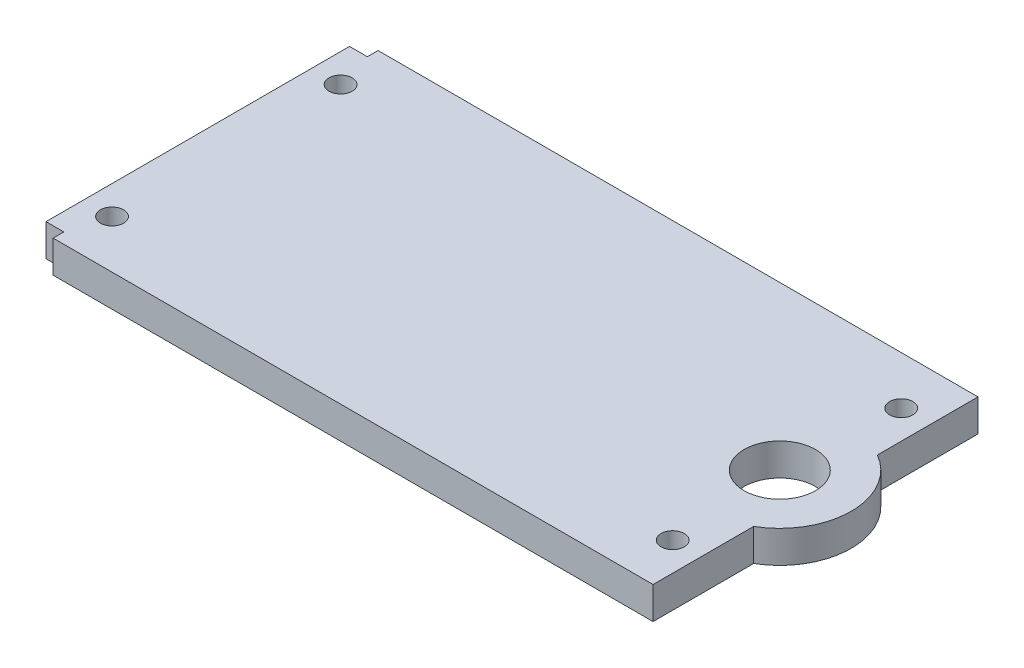
ISO-10303-21;
HEADER;
FILE_DESCRIPTION(('STEP AP214'),'2;1');
FILE_NAME('part.step','',(''),(''),'','','');
FILE_SCHEMA(('AUTOMOTIVE_DESIGN { 1 0 10303 214 1 1 1 1 }'));
ENDSEC;
DATA;
#1=APPLICATION_CONTEXT('core data for automotive mechanical design processes');
#2=APPLICATION_PROTOCOL_DEFINITION('international standard','automotive_design',2000,#1);
#3=PRODUCT_CONTEXT('',#1,'mechanical');
#4=PRODUCT('Part','Part','',(#3));
#5=PRODUCT_RELATED_PRODUCT_CATEGORY('part','',(#4));
#6=PRODUCT_DEFINITION_FORMATION('','',#4);
#7=PRODUCT_DEFINITION_CONTEXT('part definition',#1,'design');
#8=PRODUCT_DEFINITION('design','',#6,#7);
#9=PRODUCT_DEFINITION_SHAPE('','',#8);
#10=(LENGTH_UNIT() NAMED_UNIT(*) SI_UNIT(.MILLI.,.METRE.));
#11=(NAMED_UNIT(*) PLANE_ANGLE_UNIT() SI_UNIT($,.RADIAN.));
#12=(NAMED_UNIT(*) SI_UNIT($,.STERADIAN.) SOLID_ANGLE_UNIT());
#13=UNCERTAINTY_MEASURE_WITH_UNIT(LENGTH_MEASURE(1.E-05),#10,'distance_accuracy_value','');
#14=(GEOMETRIC_REPRESENTATION_CONTEXT(3) GLOBAL_UNCERTAINTY_ASSIGNED_CONTEXT((#13)) GLOBAL_UNIT_ASSIGNED_CONTEXT((#10,
#11,#12)) REPRESENTATION_CONTEXT('',''));
#15=CARTESIAN_POINT('',(0.,0.,0.));
#16=DIRECTION('',(0.,0.,1.));
#17=DIRECTION('',(1.,0.,0.));
#18=AXIS2_PLACEMENT_3D('',#15,#16,#17);
#19=CARTESIAN_POINT('',(45.,4.5,22.75));
#20=DIRECTION('',(-1.,0.,0.));
#21=DIRECTION('',(0.,0.,1.));
#22=AXIS2_PLACEMENT_3D('',#19,#20,#21);
#23=PLANE('',#22);
#24=DIRECTION('',(0.,0.,-1.));
#25=VECTOR('',#24,1.);
#26=CARTESIAN_POINT('',(45.,0.,22.75));
#27=LINE('',#26,#25);
#28=CARTESIAN_POINT('',(45.,0.,22.75));
#29=VERTEX_POINT('',#28);
#30=CARTESIAN_POINT('',(45.,0.,8.66025403784439));
#31=VERTEX_POINT('',#30);
#32=EDGE_CURVE('E130',#29,#31,#27,.T.);
#33=ORIENTED_EDGE('',*,*,#32,.T.);
#34=DIRECTION('',(0.,1.,0.));
#35=VECTOR('',#34,1.);
#36=CARTESIAN_POINT('',(45.,-28.2842712474619,8.66025403784439));
#37=LINE('',#36,#35);
#38=CARTESIAN_POINT('',(45.,4.5,8.66025403784439));
#39=VERTEX_POINT('',#38);
#40=EDGE_CURVE('E181',#31,#39,#37,.T.);
#41=ORIENTED_EDGE('',*,*,#40,.T.);
#42=DIRECTION('',(0.,0.,-1.));
#43=VECTOR('',#42,1.);
#44=CARTESIAN_POINT('',(45.,4.5,22.75));
#45=LINE('',#44,#43);
#46=CARTESIAN_POINT('',(45.,4.5,22.75));
#47=VERTEX_POINT('',#46);
#48=EDGE_CURVE('E150',#47,#39,#45,.T.);
#49=ORIENTED_EDGE('',*,*,#48,.F.);
#50=DIRECTION('',(0.,-1.,0.));
#51=VECTOR('',#50,1.);
#52=CARTESIAN_POINT('',(45.,4.5,22.75));
#53=LINE('',#52,#51);
#54=EDGE_CURVE('E11',#47,#29,#53,.T.);
#55=ORIENTED_EDGE('',*,*,#54,.T.);
#56=EDGE_LOOP('',(#33,#41,#49,#55));
#57=FACE_BOUND('',#56,.T.);
#58=ADVANCED_FACE('F31',(#57),#23,.F.);
#59=CARTESIAN_POINT('',(-41.5,4.5,22.75));
#60=DIRECTION('',(1.,0.,0.));
#61=DIRECTION('',(0.,0.,-1.));
#62=AXIS2_PLACEMENT_3D('',#59,#60,#61);
#63=PLANE('',#62);
#64=DIRECTION('',(0.,0.,1.));
#65=VECTOR('',#64,1.);
#66=CARTESIAN_POINT('',(-41.5,0.,22.75));
#67=LINE('',#66,#65);
#68=CARTESIAN_POINT('',(-41.5,0.,-21.25));
#69=VERTEX_POINT('',#68);
#70=CARTESIAN_POINT('',(-41.5,0.,21.25));
#71=VERTEX_POINT('',#70);
#72=EDGE_CURVE('E132',#69,#71,#67,.T.);
#73=ORIENTED_EDGE('',*,*,#72,.T.);
#74=DIRECTION('',(0.,1.,0.));
#75=VECTOR('',#74,1.);
#76=CARTESIAN_POINT('',(-41.5,0.,21.25));
#77=LINE('',#76,#75);
#78=CARTESIAN_POINT('',(-41.5,4.5,21.25));
#79=VERTEX_POINT('',#78);
#80=EDGE_CURVE('E213',#71,#79,#77,.T.);
#81=ORIENTED_EDGE('',*,*,#80,.T.);
#82=DIRECTION('',(0.,0.,1.));
#83=VECTOR('',#82,1.);
#84=CARTESIAN_POINT('',(-41.5,4.5,22.75));
#85=LINE('',#84,#83);
#86=CARTESIAN_POINT('',(-41.5,4.5,-21.25));
#87=VERTEX_POINT('',#86);
#88=EDGE_CURVE('E142',#87,#79,#85,.T.);
#89=ORIENTED_EDGE('',*,*,#88,.F.);
#90=DIRECTION('',(0.,1.,0.));
#91=VECTOR('',#90,1.);
#92=CARTESIAN_POINT('',(-41.5,0.,-21.25));
#93=LINE('',#92,#91);
#94=EDGE_CURVE('E201',#69,#87,#93,.T.);
#95=ORIENTED_EDGE('',*,*,#94,.F.);
#96=EDGE_LOOP('',(#73,#81,#89,#95));
#97=FACE_BOUND('',#96,.T.);
#98=ADVANCED_FACE('F33',(#97),#63,.F.);
#99=CARTESIAN_POINT('',(-41.5,4.5,22.75));
#100=DIRECTION('',(0.,0.,-1.));
#101=DIRECTION('',(-1.,0.,0.));
#102=AXIS2_PLACEMENT_3D('',#99,#100,#101);
#103=PLANE('',#102);
#104=DIRECTION('',(1.,0.,0.));
#105=VECTOR('',#104,1.);
#106=CARTESIAN_POINT('',(-41.5,4.5,22.75));
#107=LINE('',#106,#105);
#108=CARTESIAN_POINT('',(-39.,4.5,22.75));
#109=VERTEX_POINT('',#108);
#110=EDGE_CURVE('E123',#109,#47,#107,.T.);
#111=ORIENTED_EDGE('',*,*,#110,.F.);
#112=DIRECTION('',(0.,1.,0.));
#113=VECTOR('',#112,1.);
#114=CARTESIAN_POINT('',(-39.,0.,22.75));
#115=LINE('',#114,#113);
#116=CARTESIAN_POINT('',(-39.,0.,22.75));
#117=VERTEX_POINT('',#116);
#118=EDGE_CURVE('E111',#117,#109,#115,.T.);
#119=ORIENTED_EDGE('',*,*,#118,.F.);
#120=DIRECTION('',(1.,0.,0.));
#121=VECTOR('',#120,1.);
#122=CARTESIAN_POINT('',(-41.5,0.,22.75));
#123=LINE('',#122,#121);
#124=EDGE_CURVE('E122',#117,#29,#123,.T.);
#125=ORIENTED_EDGE('',*,*,#124,.T.);
#126=ORIENTED_EDGE('',*,*,#54,.F.);
#127=EDGE_LOOP('',(#111,#119,#125,#126));
#128=FACE_BOUND('',#127,.T.);
#129=ADVANCED_FACE('F120',(#128),#103,.F.);
#130=CARTESIAN_POINT('',(45.,4.5,-8.66025403784439));
#131=VERTEX_POINT('',#130);
#132=CARTESIAN_POINT('',(45.,4.5,-22.75));
#133=VERTEX_POINT('',#132);
#134=EDGE_CURVE('E154',#131,#133,#45,.T.);
#135=ORIENTED_EDGE('',*,*,#134,.F.);
#136=DIRECTION('',(0.,1.,0.));
#137=VECTOR('',#136,1.);
#138=CARTESIAN_POINT('',(45.,-28.2842712474619,-8.66025403784439));
#139=LINE('',#138,#137);
#140=CARTESIAN_POINT('',(45.,0.,-8.66025403784439));
#141=VERTEX_POINT('',#140);
#142=EDGE_CURVE('E186',#131,#141,#139,.F.);
#143=ORIENTED_EDGE('',*,*,#142,.T.);
#144=CARTESIAN_POINT('',(45.,0.,-22.75));
#145=VERTEX_POINT('',#144);
#146=EDGE_CURVE('E131',#141,#145,#27,.T.);
#147=ORIENTED_EDGE('',*,*,#146,.T.);
#148=DIRECTION('',(0.,-1.,0.));
#149=VECTOR('',#148,1.);
#150=CARTESIAN_POINT('',(45.,4.5,-22.75));
#151=LINE('',#150,#149);
#152=EDGE_CURVE('E39',#133,#145,#151,.T.);
#153=ORIENTED_EDGE('',*,*,#152,.F.);
#154=EDGE_LOOP('',(#135,#143,#147,#153));
#155=FACE_BOUND('',#154,.T.);
#156=ADVANCED_FACE('F237',(#155),#23,.F.);
#157=CARTESIAN_POINT('',(-41.5,4.5,-22.75));
#158=DIRECTION('',(0.,0.,1.));
#159=DIRECTION('',(1.,0.,0.));
#160=AXIS2_PLACEMENT_3D('',#157,#158,#159);
#161=PLANE('',#160);
#162=DIRECTION('',(-1.,0.,0.));
#163=VECTOR('',#162,1.);
#164=CARTESIAN_POINT('',(-41.5,0.,-22.75));
#165=LINE('',#164,#163);
#166=CARTESIAN_POINT('',(-39.,0.,-22.75));
#167=VERTEX_POINT('',#166);
#168=EDGE_CURVE('E140',#145,#167,#165,.T.);
#169=ORIENTED_EDGE('',*,*,#168,.T.);
#170=DIRECTION('',(0.,1.,0.));
#171=VECTOR('',#170,1.);
#172=CARTESIAN_POINT('',(-39.,0.,-22.75));
#173=LINE('',#172,#171);
#174=CARTESIAN_POINT('',(-39.,4.5,-22.75));
#175=VERTEX_POINT('',#174);
#176=EDGE_CURVE('E198',#167,#175,#173,.T.);
#177=ORIENTED_EDGE('',*,*,#176,.T.);
#178=DIRECTION('',(-1.,0.,0.));
#179=VECTOR('',#178,1.);
#180=CARTESIAN_POINT('',(-41.5,4.5,-22.75));
#181=LINE('',#180,#179);
#182=EDGE_CURVE('E144',#133,#175,#181,.T.);
#183=ORIENTED_EDGE('',*,*,#182,.F.);
#184=ORIENTED_EDGE('',*,*,#152,.T.);
#185=EDGE_LOOP('',(#169,#177,#183,#184));
#186=FACE_BOUND('',#185,.T.);
#187=ADVANCED_FACE('F233',(#186),#161,.F.);
#188=CARTESIAN_POINT('',(-41.5,4.5,-22.75));
#189=DIRECTION('',(0.,-1.,0.));
#190=DIRECTION('',(0.,0.,-1.));
#191=AXIS2_PLACEMENT_3D('',#188,#189,#190);
#192=PLANE('',#191);
#193=CARTESIAN_POINT('',(40.,4.5,0.));
#194=DIRECTION('',(0.,1.,0.));
#195=DIRECTION('',(0.,0.,1.));
#196=AXIS2_PLACEMENT_3D('',#193,#194,#195);
#197=CIRCLE('',#196,5.);
#198=CARTESIAN_POINT('',(40.,4.5,5.));
#199=VERTEX_POINT('',#198);
#200=EDGE_CURVE('E195',#199,#199,#197,.T.);
#201=ORIENTED_EDGE('',*,*,#200,.F.);
#202=EDGE_LOOP('',(#201));
#203=FACE_BOUND('',#202,.T.);
#204=CARTESIAN_POINT('',(41.,4.5,16.));
#205=DIRECTION('',(0.,1.,0.));
#206=DIRECTION('',(0.,0.,1.));
#207=AXIS2_PLACEMENT_3D('',#204,#205,#206);
#208=CIRCLE('',#207,1.625);
#209=CARTESIAN_POINT('',(41.,4.5,17.625));
#210=VERTEX_POINT('',#209);
#211=EDGE_CURVE('E178',#210,#210,#208,.T.);
#212=ORIENTED_EDGE('',*,*,#211,.F.);
#213=EDGE_LOOP('',(#212));
#214=FACE_BOUND('',#213,.T.);
#215=CARTESIAN_POINT('',(41.,4.5,-16.));
#216=DIRECTION('',(0.,1.,0.));
#217=DIRECTION('',(0.,0.,1.));
#218=AXIS2_PLACEMENT_3D('',#215,#216,#217);
#219=CIRCLE('',#218,1.625);
#220=CARTESIAN_POINT('',(41.,4.5,-14.375));
#221=VERTEX_POINT('',#220);
#222=EDGE_CURVE('E172',#221,#221,#219,.T.);
#223=ORIENTED_EDGE('',*,*,#222,.F.);
#224=EDGE_LOOP('',(#223));
#225=FACE_BOUND('',#224,.T.);
#226=CARTESIAN_POINT('',(-37.5,4.5,-16.));
#227=DIRECTION('',(0.,1.,0.));
#228=DIRECTION('',(0.,0.,1.));
#229=AXIS2_PLACEMENT_3D('',#226,#227,#228);
#230=CIRCLE('',#229,1.625);
#231=CARTESIAN_POINT('',(-37.5,4.5,-14.375));
#232=VERTEX_POINT('',#231);
#233=EDGE_CURVE('E166',#232,#232,#230,.T.);
#234=ORIENTED_EDGE('',*,*,#233,.F.);
#235=EDGE_LOOP('',(#234));
#236=FACE_BOUND('',#235,.T.);
#237=CARTESIAN_POINT('',(-37.5,4.5,16.));
#238=DIRECTION('',(0.,1.,0.));
#239=DIRECTION('',(0.,0.,1.));
#240=AXIS2_PLACEMENT_3D('',#237,#238,#239);
#241=CIRCLE('',#240,1.625);
#242=CARTESIAN_POINT('',(-37.5,4.5,17.625));
#243=VERTEX_POINT('',#242);
#244=EDGE_CURVE('E160',#243,#243,#241,.T.);
#245=ORIENTED_EDGE('',*,*,#244,.F.);
#246=EDGE_LOOP('',(#245));
#247=FACE_BOUND('',#246,.T.);
#248=ORIENTED_EDGE('',*,*,#88,.T.);
#249=DIRECTION('',(-1.,0.,0.));
#250=VECTOR('',#249,1.);
#251=CARTESIAN_POINT('',(-41.5,4.5,21.25));
#252=LINE('',#251,#250);
#253=CARTESIAN_POINT('',(-39.,4.5,21.25));
#254=VERTEX_POINT('',#253);
#255=EDGE_CURVE('E116',#254,#79,#252,.T.);
#256=ORIENTED_EDGE('',*,*,#255,.F.);
#257=DIRECTION('',(0.,0.,-1.));
#258=VECTOR('',#257,1.);
#259=CARTESIAN_POINT('',(-39.,4.5,22.75));
#260=LINE('',#259,#258);
#261=EDGE_CURVE('E221',#109,#254,#260,.T.);
#262=ORIENTED_EDGE('',*,*,#261,.F.);
#263=ORIENTED_EDGE('',*,*,#110,.T.);
#264=ORIENTED_EDGE('',*,*,#48,.T.);
#265=CARTESIAN_POINT('',(40.,4.5,0.));
#266=DIRECTION('',(0.,1.,0.));
#267=DIRECTION('',(0.,0.,1.));
#268=AXIS2_PLACEMENT_3D('',#265,#266,#267);
#269=CIRCLE('',#268,10.);
#270=EDGE_CURVE('E191',#39,#131,#269,.T.);
#271=ORIENTED_EDGE('',*,*,#270,.T.);
#272=ORIENTED_EDGE('',*,*,#134,.T.);
#273=ORIENTED_EDGE('',*,*,#182,.T.);
#274=DIRECTION('',(0.,0.,-1.));
#275=VECTOR('',#274,1.);
#276=CARTESIAN_POINT('',(-39.,4.5,-22.75));
#277=LINE('',#276,#275);
#278=CARTESIAN_POINT('',(-39.,4.5,-21.25));
#279=VERTEX_POINT('',#278);
#280=EDGE_CURVE('E207',#279,#175,#277,.T.);
#281=ORIENTED_EDGE('',*,*,#280,.F.);
#282=DIRECTION('',(1.,0.,0.));
#283=VECTOR('',#282,1.);
#284=CARTESIAN_POINT('',(-41.5,4.5,-21.25));
#285=LINE('',#284,#283);
#286=EDGE_CURVE('E210',#87,#279,#285,.T.);
#287=ORIENTED_EDGE('',*,*,#286,.F.);
#288=EDGE_LOOP('',(#248,#256,#262,#263,#264,#271,#272,#273,#281,#287));
#289=FACE_BOUND('',#288,.T.);
#290=ADVANCED_FACE('F230',(#203,#214,#225,#236,#247,#289),#192,.F.);
#291=CARTESIAN_POINT('',(-41.5,0.,-22.75));
#292=DIRECTION('',(0.,-1.,0.));
#293=DIRECTION('',(0.,0.,-1.));
#294=AXIS2_PLACEMENT_3D('',#291,#292,#293);
#295=PLANE('',#294);
#296=DIRECTION('',(-1.,0.,0.));
#297=VECTOR('',#296,1.);
#298=CARTESIAN_POINT('',(-41.5,0.,21.25));
#299=LINE('',#298,#297);
#300=CARTESIAN_POINT('',(-39.,0.,21.25));
#301=VERTEX_POINT('',#300);
#302=EDGE_CURVE('E46',#301,#71,#299,.T.);
#303=ORIENTED_EDGE('',*,*,#302,.T.);
#304=ORIENTED_EDGE('',*,*,#72,.F.);
#305=DIRECTION('',(1.,0.,0.));
#306=VECTOR('',#305,1.);
#307=CARTESIAN_POINT('',(-41.5,0.,-21.25));
#308=LINE('',#307,#306);
#309=CARTESIAN_POINT('',(-39.,0.,-21.25));
#310=VERTEX_POINT('',#309);
#311=EDGE_CURVE('E209',#69,#310,#308,.T.);
#312=ORIENTED_EDGE('',*,*,#311,.T.);
#313=DIRECTION('',(0.,0.,-1.));
#314=VECTOR('',#313,1.);
#315=CARTESIAN_POINT('',(-39.,0.,-22.75));
#316=LINE('',#315,#314);
#317=EDGE_CURVE('E54',#310,#167,#316,.T.);
#318=ORIENTED_EDGE('',*,*,#317,.T.);
#319=ORIENTED_EDGE('',*,*,#168,.F.);
#320=ORIENTED_EDGE('',*,*,#146,.F.);
#321=CARTESIAN_POINT('',(40.,0.,0.));
#322=DIRECTION('',(0.,-1.,0.));
#323=DIRECTION('',(0.,0.,-1.));
#324=AXIS2_PLACEMENT_3D('',#321,#322,#323);
#325=CIRCLE('',#324,10.);
#326=EDGE_CURVE('E189',#31,#141,#325,.F.);
#327=ORIENTED_EDGE('',*,*,#326,.F.);
#328=ORIENTED_EDGE('',*,*,#32,.F.);
#329=ORIENTED_EDGE('',*,*,#124,.F.);
#330=DIRECTION('',(0.,0.,-1.));
#331=VECTOR('',#330,1.);
#332=CARTESIAN_POINT('',(-39.,0.,22.75));
#333=LINE('',#332,#331);
#334=EDGE_CURVE('E107',#117,#301,#333,.T.);
#335=ORIENTED_EDGE('',*,*,#334,.T.);
#336=EDGE_LOOP('',(#303,#304,#312,#318,#319,#320,#327,#328,#329,#335));
#337=FACE_BOUND('',#336,.T.);
#338=CARTESIAN_POINT('',(40.,0.,0.));
#339=DIRECTION('',(0.,1.,0.));
#340=DIRECTION('',(0.,0.,1.));
#341=AXIS2_PLACEMENT_3D('',#338,#339,#340);
#342=CIRCLE('',#341,5.);
#343=CARTESIAN_POINT('',(40.,0.,5.));
#344=VERTEX_POINT('',#343);
#345=EDGE_CURVE('E194',#344,#344,#342,.T.);
#346=ORIENTED_EDGE('',*,*,#345,.T.);
#347=EDGE_LOOP('',(#346));
#348=FACE_BOUND('',#347,.T.);
#349=CARTESIAN_POINT('',(41.,0.,16.));
#350=DIRECTION('',(0.,1.,0.));
#351=DIRECTION('',(0.,0.,1.));
#352=AXIS2_PLACEMENT_3D('',#349,#350,#351);
#353=CIRCLE('',#352,1.625);
#354=CARTESIAN_POINT('',(41.,0.,17.625));
#355=VERTEX_POINT('',#354);
#356=EDGE_CURVE('E175',#355,#355,#353,.T.);
#357=ORIENTED_EDGE('',*,*,#356,.T.);
#358=EDGE_LOOP('',(#357));
#359=FACE_BOUND('',#358,.T.);
#360=CARTESIAN_POINT('',(41.,0.,-16.));
#361=DIRECTION('',(0.,1.,0.));
#362=DIRECTION('',(0.,0.,1.));
#363=AXIS2_PLACEMENT_3D('',#360,#361,#362);
#364=CIRCLE('',#363,1.625);
#365=CARTESIAN_POINT('',(41.,0.,-14.375));
#366=VERTEX_POINT('',#365);
#367=EDGE_CURVE('E169',#366,#366,#364,.T.);
#368=ORIENTED_EDGE('',*,*,#367,.T.);
#369=EDGE_LOOP('',(#368));
#370=FACE_BOUND('',#369,.T.);
#371=CARTESIAN_POINT('',(-37.5,0.,-16.));
#372=DIRECTION('',(0.,1.,0.));
#373=DIRECTION('',(0.,0.,1.));
#374=AXIS2_PLACEMENT_3D('',#371,#372,#373);
#375=CIRCLE('',#374,1.625);
#376=CARTESIAN_POINT('',(-37.5,0.,-14.375));
#377=VERTEX_POINT('',#376);
#378=EDGE_CURVE('E163',#377,#377,#375,.T.);
#379=ORIENTED_EDGE('',*,*,#378,.T.);
#380=EDGE_LOOP('',(#379));
#381=FACE_BOUND('',#380,.T.);
#382=CARTESIAN_POINT('',(-37.5,0.,16.));
#383=DIRECTION('',(0.,1.,0.));
#384=DIRECTION('',(0.,0.,1.));
#385=AXIS2_PLACEMENT_3D('',#382,#383,#384);
#386=CIRCLE('',#385,1.625);
#387=CARTESIAN_POINT('',(-37.5,0.,17.625));
#388=VERTEX_POINT('',#387);
#389=EDGE_CURVE('E136',#388,#388,#386,.T.);
#390=ORIENTED_EDGE('',*,*,#389,.T.);
#391=EDGE_LOOP('',(#390));
#392=FACE_BOUND('',#391,.T.);
#393=ADVANCED_FACE('F126',(#337,#348,#359,#370,#381,#392),#295,.T.);
#394=CARTESIAN_POINT('',(-37.5,0.,16.));
#395=DIRECTION('',(0.,1.,0.));
#396=DIRECTION('',(0.,0.,1.));
#397=AXIS2_PLACEMENT_3D('',#394,#395,#396);
#398=CYLINDRICAL_SURFACE('',#397,1.625);
#399=ORIENTED_EDGE('',*,*,#389,.F.);
#400=EDGE_LOOP('',(#399));
#401=FACE_BOUND('',#400,.T.);
#402=ORIENTED_EDGE('',*,*,#244,.T.);
#403=EDGE_LOOP('',(#402));
#404=FACE_BOUND('',#403,.T.);
#405=ADVANCED_FACE('F321',(#401,#404),#398,.F.);
#406=CARTESIAN_POINT('',(-37.5,0.,-16.));
#407=DIRECTION('',(0.,1.,0.));
#408=DIRECTION('',(0.,0.,1.));
#409=AXIS2_PLACEMENT_3D('',#406,#407,#408);
#410=CYLINDRICAL_SURFACE('',#409,1.625);
#411=ORIENTED_EDGE('',*,*,#378,.F.);
#412=EDGE_LOOP('',(#411));
#413=FACE_BOUND('',#412,.T.);
#414=ORIENTED_EDGE('',*,*,#233,.T.);
#415=EDGE_LOOP('',(#414));
#416=FACE_BOUND('',#415,.T.);
#417=ADVANCED_FACE('F311',(#413,#416),#410,.F.);
#418=CARTESIAN_POINT('',(41.,0.,-16.));
#419=DIRECTION('',(0.,1.,0.));
#420=DIRECTION('',(0.,0.,1.));
#421=AXIS2_PLACEMENT_3D('',#418,#419,#420);
#422=CYLINDRICAL_SURFACE('',#421,1.625);
#423=ORIENTED_EDGE('',*,*,#367,.F.);
#424=EDGE_LOOP('',(#423));
#425=FACE_BOUND('',#424,.T.);
#426=ORIENTED_EDGE('',*,*,#222,.T.);
#427=EDGE_LOOP('',(#426));
#428=FACE_BOUND('',#427,.T.);
#429=ADVANCED_FACE('F301',(#425,#428),#422,.F.);
#430=CARTESIAN_POINT('',(41.,0.,16.));
#431=DIRECTION('',(0.,1.,0.));
#432=DIRECTION('',(0.,0.,1.));
#433=AXIS2_PLACEMENT_3D('',#430,#431,#432);
#434=CYLINDRICAL_SURFACE('',#433,1.625);
#435=ORIENTED_EDGE('',*,*,#356,.F.);
#436=EDGE_LOOP('',(#435));
#437=FACE_BOUND('',#436,.T.);
#438=ORIENTED_EDGE('',*,*,#211,.T.);
#439=EDGE_LOOP('',(#438));
#440=FACE_BOUND('',#439,.T.);
#441=ADVANCED_FACE('F280',(#437,#440),#434,.F.);
#442=CARTESIAN_POINT('',(40.,-28.2842712474619,0.));
#443=DIRECTION('',(0.,1.,0.));
#444=DIRECTION('',(0.,0.,1.));
#445=AXIS2_PLACEMENT_3D('',#442,#443,#444);
#446=CYLINDRICAL_SURFACE('',#445,10.);
#447=ORIENTED_EDGE('',*,*,#40,.F.);
#448=ORIENTED_EDGE('',*,*,#326,.T.);
#449=ORIENTED_EDGE('',*,*,#142,.F.);
#450=ORIENTED_EDGE('',*,*,#270,.F.);
#451=EDGE_LOOP('',(#447,#448,#449,#450));
#452=FACE_BOUND('',#451,.T.);
#453=ADVANCED_FACE('F239',(#452),#446,.T.);
#454=CARTESIAN_POINT('',(40.,0.,0.));
#455=DIRECTION('',(0.,1.,0.));
#456=DIRECTION('',(0.,0.,1.));
#457=AXIS2_PLACEMENT_3D('',#454,#455,#456);
#458=CYLINDRICAL_SURFACE('',#457,5.);
#459=ORIENTED_EDGE('',*,*,#345,.F.);
#460=EDGE_LOOP('',(#459));
#461=FACE_BOUND('',#460,.T.);
#462=ORIENTED_EDGE('',*,*,#200,.T.);
#463=EDGE_LOOP('',(#462));
#464=FACE_BOUND('',#463,.T.);
#465=ADVANCED_FACE('F265',(#461,#464),#458,.F.);
#466=CARTESIAN_POINT('',(-39.,0.,-22.75));
#467=DIRECTION('',(1.,0.,0.));
#468=DIRECTION('',(0.,0.,-1.));
#469=AXIS2_PLACEMENT_3D('',#466,#467,#468);
#470=PLANE('',#469);
#471=ORIENTED_EDGE('',*,*,#280,.T.);
#472=ORIENTED_EDGE('',*,*,#176,.F.);
#473=ORIENTED_EDGE('',*,*,#317,.F.);
#474=DIRECTION('',(0.,1.,0.));
#475=VECTOR('',#474,1.);
#476=CARTESIAN_POINT('',(-39.,0.,-21.25));
#477=LINE('',#476,#475);
#478=EDGE_CURVE('E203',#310,#279,#477,.T.);
#479=ORIENTED_EDGE('',*,*,#478,.T.);
#480=EDGE_LOOP('',(#471,#472,#473,#479));
#481=FACE_BOUND('',#480,.T.);
#482=ADVANCED_FACE('F232',(#481),#470,.F.);
#483=CARTESIAN_POINT('',(-41.5,0.,-21.25));
#484=DIRECTION('',(0.,0.,1.));
#485=DIRECTION('',(1.,0.,0.));
#486=AXIS2_PLACEMENT_3D('',#483,#484,#485);
#487=PLANE('',#486);
#488=ORIENTED_EDGE('',*,*,#286,.T.);
#489=ORIENTED_EDGE('',*,*,#478,.F.);
#490=ORIENTED_EDGE('',*,*,#311,.F.);
#491=ORIENTED_EDGE('',*,*,#94,.T.);
#492=EDGE_LOOP('',(#488,#489,#490,#491));
#493=FACE_BOUND('',#492,.T.);
#494=ADVANCED_FACE('F229',(#493),#487,.F.);
#495=CARTESIAN_POINT('',(-41.5,0.,21.25));
#496=DIRECTION('',(0.,0.,-1.));
#497=DIRECTION('',(-1.,0.,0.));
#498=AXIS2_PLACEMENT_3D('',#495,#496,#497);
#499=PLANE('',#498);
#500=ORIENTED_EDGE('',*,*,#255,.T.);
#501=ORIENTED_EDGE('',*,*,#80,.F.);
#502=ORIENTED_EDGE('',*,*,#302,.F.);
#503=DIRECTION('',(0.,1.,0.));
#504=VECTOR('',#503,1.);
#505=CARTESIAN_POINT('',(-39.,0.,21.25));
#506=LINE('',#505,#504);
#507=EDGE_CURVE('E113',#301,#254,#506,.T.);
#508=ORIENTED_EDGE('',*,*,#507,.T.);
#509=EDGE_LOOP('',(#500,#501,#502,#508));
#510=FACE_BOUND('',#509,.T.);
#511=ADVANCED_FACE('F366',(#510),#499,.F.);
#512=CARTESIAN_POINT('',(-39.,0.,22.75));
#513=DIRECTION('',(1.,0.,0.));
#514=DIRECTION('',(0.,0.,-1.));
#515=AXIS2_PLACEMENT_3D('',#512,#513,#514);
#516=PLANE('',#515);
#517=ORIENTED_EDGE('',*,*,#261,.T.);
#518=ORIENTED_EDGE('',*,*,#507,.F.);
#519=ORIENTED_EDGE('',*,*,#334,.F.);
#520=ORIENTED_EDGE('',*,*,#118,.T.);
#521=EDGE_LOOP('',(#517,#518,#519,#520));
#522=FACE_BOUND('',#521,.T.);
#523=ADVANCED_FACE('F110',(#522),#516,.F.);
#524=CLOSED_SHELL('',(#58,#98,#129,#156,#187,#290,#393,#405,#417,#429,#441,#453,#465,#482,#494,
#511,#523));
#525=MANIFOLD_SOLID_BREP('B2',#524);
#526=ADVANCED_BREP_SHAPE_REPRESENTATION('',(#18,#525),#14);
#527=SHAPE_DEFINITION_REPRESENTATION(#9,#526);
ENDSEC;
END-ISO-10303-21;
